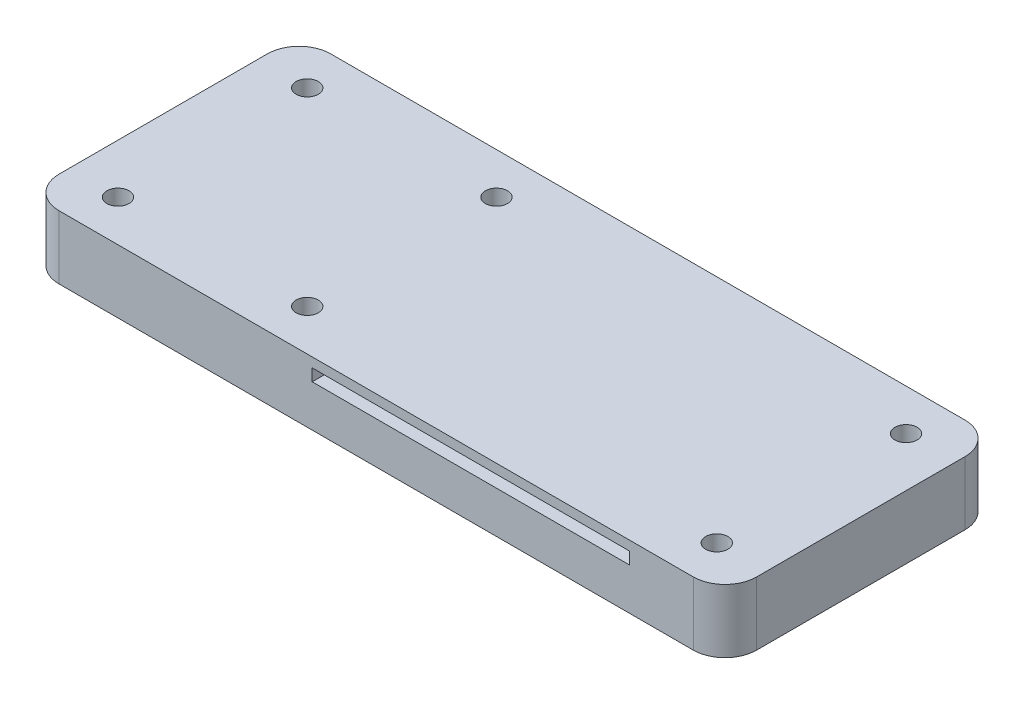
ISO-10303-21;
HEADER;
FILE_DESCRIPTION(('STEP AP214'),'2;1');
FILE_NAME('part.step','',(''),(''),'','','');
FILE_SCHEMA(('AUTOMOTIVE_DESIGN { 1 0 10303 214 1 1 1 1 }'));
ENDSEC;
DATA;
#1=APPLICATION_CONTEXT('core data for automotive mechanical design processes');
#2=APPLICATION_PROTOCOL_DEFINITION('international standard','automotive_design',2000,#1);
#3=PRODUCT_CONTEXT('',#1,'mechanical');
#4=PRODUCT('Part','Part','',(#3));
#5=PRODUCT_RELATED_PRODUCT_CATEGORY('part','',(#4));
#6=PRODUCT_DEFINITION_FORMATION('','',#4);
#7=PRODUCT_DEFINITION_CONTEXT('part definition',#1,'design');
#8=PRODUCT_DEFINITION('design','',#6,#7);
#9=PRODUCT_DEFINITION_SHAPE('','',#8);
#10=(LENGTH_UNIT() NAMED_UNIT(*) SI_UNIT(.MILLI.,.METRE.));
#11=(NAMED_UNIT(*) PLANE_ANGLE_UNIT() SI_UNIT($,.RADIAN.));
#12=(NAMED_UNIT(*) SI_UNIT($,.STERADIAN.) SOLID_ANGLE_UNIT());
#13=UNCERTAINTY_MEASURE_WITH_UNIT(LENGTH_MEASURE(1.E-05),#10,'distance_accuracy_value','');
#14=(GEOMETRIC_REPRESENTATION_CONTEXT(3) GLOBAL_UNCERTAINTY_ASSIGNED_CONTEXT((#13)) GLOBAL_UNIT_ASSIGNED_CONTEXT((#10,
#11,#12)) REPRESENTATION_CONTEXT('',''));
#15=CARTESIAN_POINT('',(0.,0.,0.));
#16=DIRECTION('',(0.,0.,1.));
#17=DIRECTION('',(1.,0.,0.));
#18=AXIS2_PLACEMENT_3D('',#15,#16,#17);
#19=CARTESIAN_POINT('',(-50.,5.,16.42));
#20=DIRECTION('',(0.,1.,0.));
#21=DIRECTION('',(0.,0.,1.));
#22=AXIS2_PLACEMENT_3D('',#19,#20,#21);
#23=PLANE('',#22);
#24=CARTESIAN_POINT('',(47.2099530830362,5.,-14.9199530830362));
#25=DIRECTION('',(0.,1.,0.));
#26=DIRECTION('',(0.,0.,1.));
#27=AXIS2_PLACEMENT_3D('',#24,#25,#26);
#28=CIRCLE('',#27,1.75);
#29=CARTESIAN_POINT('',(47.2099530830362,5.,-13.1699530830361));
#30=VERTEX_POINT('',#29);
#31=EDGE_CURVE('E186',#30,#30,#28,.T.);
#32=ORIENTED_EDGE('',*,*,#31,.F.);
#33=EDGE_LOOP('',(#32));
#34=FACE_BOUND('',#33,.T.);
#35=CARTESIAN_POINT('',(-17.3700469169638,5.,14.9199530830362));
#36=DIRECTION('',(0.,1.,0.));
#37=DIRECTION('',(0.,0.,1.));
#38=AXIS2_PLACEMENT_3D('',#35,#36,#37);
#39=CIRCLE('',#38,1.75);
#40=CARTESIAN_POINT('',(-17.3700469169638,5.,16.6699530830362));
#41=VERTEX_POINT('',#40);
#42=EDGE_CURVE('E202',#41,#41,#39,.T.);
#43=ORIENTED_EDGE('',*,*,#42,.F.);
#44=EDGE_LOOP('',(#43));
#45=FACE_BOUND('',#44,.T.);
#46=CARTESIAN_POINT('',(-47.2099530830362,5.,-14.9199530830362));
#47=DIRECTION('',(0.,1.,0.));
#48=DIRECTION('',(0.,0.,1.));
#49=AXIS2_PLACEMENT_3D('',#46,#47,#48);
#50=CIRCLE('',#49,1.75);
#51=CARTESIAN_POINT('',(-47.2099530830362,5.,-13.1699530830361));
#52=VERTEX_POINT('',#51);
#53=EDGE_CURVE('E218',#52,#52,#50,.T.);
#54=ORIENTED_EDGE('',*,*,#53,.F.);
#55=EDGE_LOOP('',(#54));
#56=FACE_BOUND('',#55,.T.);
#57=CARTESIAN_POINT('',(-50.,5.,16.42));
#58=DIRECTION('',(0.,1.,0.));
#59=DIRECTION('',(0.,0.,1.));
#60=AXIS2_PLACEMENT_3D('',#57,#58,#59);
#61=CIRCLE('',#60,5.);
#62=CARTESIAN_POINT('',(-55.,5.,16.42));
#63=VERTEX_POINT('',#62);
#64=CARTESIAN_POINT('',(-50.,5.,21.42));
#65=VERTEX_POINT('',#64);
#66=EDGE_CURVE('E226',#63,#65,#61,.T.);
#67=ORIENTED_EDGE('',*,*,#66,.T.);
#68=DIRECTION('',(1.,0.,0.));
#69=VECTOR('',#68,1.);
#70=CARTESIAN_POINT('',(-50.,5.,21.42));
#71=LINE('',#70,#69);
#72=CARTESIAN_POINT('',(50.,5.,21.42));
#73=VERTEX_POINT('',#72);
#74=EDGE_CURVE('E230',#65,#73,#71,.T.);
#75=ORIENTED_EDGE('',*,*,#74,.T.);
#76=CARTESIAN_POINT('',(50.,5.,16.42));
#77=DIRECTION('',(0.,1.,0.));
#78=DIRECTION('',(0.,0.,1.));
#79=AXIS2_PLACEMENT_3D('',#76,#77,#78);
#80=CIRCLE('',#79,5.);
#81=CARTESIAN_POINT('',(55.,5.,16.42));
#82=VERTEX_POINT('',#81);
#83=EDGE_CURVE('E234',#73,#82,#80,.T.);
#84=ORIENTED_EDGE('',*,*,#83,.T.);
#85=DIRECTION('',(0.,0.,-1.));
#86=VECTOR('',#85,1.);
#87=CARTESIAN_POINT('',(55.,5.,16.42));
#88=LINE('',#87,#86);
#89=CARTESIAN_POINT('',(55.,5.,-16.42));
#90=VERTEX_POINT('',#89);
#91=EDGE_CURVE('E237',#82,#90,#88,.T.);
#92=ORIENTED_EDGE('',*,*,#91,.T.);
#93=CARTESIAN_POINT('',(50.,5.,-16.42));
#94=DIRECTION('',(0.,1.,0.));
#95=DIRECTION('',(0.,0.,1.));
#96=AXIS2_PLACEMENT_3D('',#93,#94,#95);
#97=CIRCLE('',#96,5.);
#98=CARTESIAN_POINT('',(50.,5.,-21.42));
#99=VERTEX_POINT('',#98);
#100=EDGE_CURVE('E240',#90,#99,#97,.T.);
#101=ORIENTED_EDGE('',*,*,#100,.T.);
#102=DIRECTION('',(-1.,0.,0.));
#103=VECTOR('',#102,1.);
#104=CARTESIAN_POINT('',(-50.,5.,-21.42));
#105=LINE('',#104,#103);
#106=CARTESIAN_POINT('',(-50.,5.,-21.42));
#107=VERTEX_POINT('',#106);
#108=EDGE_CURVE('E243',#99,#107,#105,.T.);
#109=ORIENTED_EDGE('',*,*,#108,.T.);
#110=CARTESIAN_POINT('',(-50.,5.,-16.42));
#111=DIRECTION('',(0.,1.,0.));
#112=DIRECTION('',(0.,0.,1.));
#113=AXIS2_PLACEMENT_3D('',#110,#111,#112);
#114=CIRCLE('',#113,5.);
#115=CARTESIAN_POINT('',(-55.,5.,-16.42));
#116=VERTEX_POINT('',#115);
#117=EDGE_CURVE('E246',#107,#116,#114,.T.);
#118=ORIENTED_EDGE('',*,*,#117,.T.);
#119=DIRECTION('',(0.,0.,1.));
#120=VECTOR('',#119,1.);
#121=CARTESIAN_POINT('',(-55.,5.,16.42));
#122=LINE('',#121,#120);
#123=EDGE_CURVE('E249',#116,#63,#122,.T.);
#124=ORIENTED_EDGE('',*,*,#123,.T.);
#125=EDGE_LOOP('',(#67,#75,#84,#92,#101,#109,#118,#124));
#126=FACE_BOUND('',#125,.T.);
#127=CARTESIAN_POINT('',(-17.3700469169638,5.,-14.9199530830362));
#128=DIRECTION('',(0.,1.,0.));
#129=DIRECTION('',(0.,0.,1.));
#130=AXIS2_PLACEMENT_3D('',#127,#128,#129);
#131=CIRCLE('',#130,1.75);
#132=CARTESIAN_POINT('',(-17.3700469169638,5.,-13.1699530830362));
#133=VERTEX_POINT('',#132);
#134=EDGE_CURVE('E210',#133,#133,#131,.T.);
#135=ORIENTED_EDGE('',*,*,#134,.F.);
#136=EDGE_LOOP('',(#135));
#137=FACE_BOUND('',#136,.T.);
#138=CARTESIAN_POINT('',(-47.2099530830362,5.,14.9199530830362));
#139=DIRECTION('',(0.,1.,0.));
#140=DIRECTION('',(0.,0.,1.));
#141=AXIS2_PLACEMENT_3D('',#138,#139,#140);
#142=CIRCLE('',#141,1.75);
#143=CARTESIAN_POINT('',(-47.2099530830362,5.,16.6699530830362));
#144=VERTEX_POINT('',#143);
#145=EDGE_CURVE('E194',#144,#144,#142,.T.);
#146=ORIENTED_EDGE('',*,*,#145,.F.);
#147=EDGE_LOOP('',(#146));
#148=FACE_BOUND('',#147,.T.);
#149=CARTESIAN_POINT('',(47.2099530830362,5.,14.9199530830362));
#150=DIRECTION('',(0.,1.,0.));
#151=DIRECTION('',(0.,0.,1.));
#152=AXIS2_PLACEMENT_3D('',#149,#150,#151);
#153=CIRCLE('',#152,1.75);
#154=CARTESIAN_POINT('',(47.2099530830362,5.,16.6699530830362));
#155=VERTEX_POINT('',#154);
#156=EDGE_CURVE('E178',#155,#155,#153,.T.);
#157=ORIENTED_EDGE('',*,*,#156,.F.);
#158=EDGE_LOOP('',(#157));
#159=FACE_BOUND('',#158,.T.);
#160=ADVANCED_FACE('F39',(#34,#45,#56,#126,#137,#148,#159),#23,.T.);
#161=CARTESIAN_POINT('',(-50.,-5.,16.42));
#162=DIRECTION('',(0.,1.,0.));
#163=DIRECTION('',(0.,0.,1.));
#164=AXIS2_PLACEMENT_3D('',#161,#162,#163);
#165=PLANE('',#164);
#166=CARTESIAN_POINT('',(-50.,-5.,16.42));
#167=DIRECTION('',(0.,1.,0.));
#168=DIRECTION('',(0.,0.,1.));
#169=AXIS2_PLACEMENT_3D('',#166,#167,#168);
#170=CIRCLE('',#169,5.);
#171=CARTESIAN_POINT('',(-55.,-5.,16.42));
#172=VERTEX_POINT('',#171);
#173=CARTESIAN_POINT('',(-50.,-5.,21.42));
#174=VERTEX_POINT('',#173);
#175=EDGE_CURVE('E222',#172,#174,#170,.T.);
#176=ORIENTED_EDGE('',*,*,#175,.F.);
#177=DIRECTION('',(0.,0.,1.));
#178=VECTOR('',#177,1.);
#179=CARTESIAN_POINT('',(-55.,-5.,16.42));
#180=LINE('',#179,#178);
#181=CARTESIAN_POINT('',(-55.,-5.,-16.42));
#182=VERTEX_POINT('',#181);
#183=EDGE_CURVE('E231',#182,#172,#180,.T.);
#184=ORIENTED_EDGE('',*,*,#183,.F.);
#185=CARTESIAN_POINT('',(-50.,-5.,-16.42));
#186=DIRECTION('',(0.,1.,0.));
#187=DIRECTION('',(0.,0.,1.));
#188=AXIS2_PLACEMENT_3D('',#185,#186,#187);
#189=CIRCLE('',#188,5.);
#190=CARTESIAN_POINT('',(-50.,-5.,-21.42));
#191=VERTEX_POINT('',#190);
#192=EDGE_CURVE('E271',#191,#182,#189,.T.);
#193=ORIENTED_EDGE('',*,*,#192,.F.);
#194=DIRECTION('',(-1.,0.,0.));
#195=VECTOR('',#194,1.);
#196=CARTESIAN_POINT('',(-50.,-5.,-21.42));
#197=LINE('',#196,#195);
#198=CARTESIAN_POINT('',(50.,-5.,-21.42));
#199=VERTEX_POINT('',#198);
#200=EDGE_CURVE('E268',#199,#191,#197,.T.);
#201=ORIENTED_EDGE('',*,*,#200,.F.);
#202=CARTESIAN_POINT('',(50.,-5.,-16.42));
#203=DIRECTION('',(0.,1.,0.));
#204=DIRECTION('',(0.,0.,1.));
#205=AXIS2_PLACEMENT_3D('',#202,#203,#204);
#206=CIRCLE('',#205,5.);
#207=CARTESIAN_POINT('',(55.,-5.,-16.42));
#208=VERTEX_POINT('',#207);
#209=EDGE_CURVE('E265',#208,#199,#206,.T.);
#210=ORIENTED_EDGE('',*,*,#209,.F.);
#211=DIRECTION('',(0.,0.,-1.));
#212=VECTOR('',#211,1.);
#213=CARTESIAN_POINT('',(55.,-5.,16.42));
#214=LINE('',#213,#212);
#215=CARTESIAN_POINT('',(55.,-5.,16.42));
#216=VERTEX_POINT('',#215);
#217=EDGE_CURVE('E262',#216,#208,#214,.T.);
#218=ORIENTED_EDGE('',*,*,#217,.F.);
#219=CARTESIAN_POINT('',(50.,-5.,16.42));
#220=DIRECTION('',(0.,1.,0.));
#221=DIRECTION('',(0.,0.,1.));
#222=AXIS2_PLACEMENT_3D('',#219,#220,#221);
#223=CIRCLE('',#222,5.);
#224=CARTESIAN_POINT('',(50.,-5.,21.42));
#225=VERTEX_POINT('',#224);
#226=EDGE_CURVE('E259',#225,#216,#223,.T.);
#227=ORIENTED_EDGE('',*,*,#226,.F.);
#228=DIRECTION('',(1.,0.,0.));
#229=VECTOR('',#228,1.);
#230=CARTESIAN_POINT('',(-50.,-5.,21.42));
#231=LINE('',#230,#229);
#232=EDGE_CURVE('E256',#174,#225,#231,.T.);
#233=ORIENTED_EDGE('',*,*,#232,.F.);
#234=EDGE_LOOP('',(#176,#184,#193,#201,#210,#218,#227,#233));
#235=FACE_BOUND('',#234,.T.);
#236=CARTESIAN_POINT('',(-47.2099530830362,-5.,-14.9199530830362));
#237=DIRECTION('',(0.,1.,0.));
#238=DIRECTION('',(0.,0.,1.));
#239=AXIS2_PLACEMENT_3D('',#236,#237,#238);
#240=CIRCLE('',#239,1.75);
#241=CARTESIAN_POINT('',(-47.2099530830362,-5.,-13.1699530830361));
#242=VERTEX_POINT('',#241);
#243=EDGE_CURVE('E214',#242,#242,#240,.T.);
#244=ORIENTED_EDGE('',*,*,#243,.T.);
#245=EDGE_LOOP('',(#244));
#246=FACE_BOUND('',#245,.T.);
#247=CARTESIAN_POINT('',(-17.3700469169638,-5.,-14.9199530830362));
#248=DIRECTION('',(0.,1.,0.));
#249=DIRECTION('',(0.,0.,1.));
#250=AXIS2_PLACEMENT_3D('',#247,#248,#249);
#251=CIRCLE('',#250,1.75);
#252=CARTESIAN_POINT('',(-17.3700469169638,-5.,-13.1699530830362));
#253=VERTEX_POINT('',#252);
#254=EDGE_CURVE('E206',#253,#253,#251,.T.);
#255=ORIENTED_EDGE('',*,*,#254,.T.);
#256=EDGE_LOOP('',(#255));
#257=FACE_BOUND('',#256,.T.);
#258=CARTESIAN_POINT('',(-17.3700469169638,-5.,14.9199530830362));
#259=DIRECTION('',(0.,1.,0.));
#260=DIRECTION('',(0.,0.,1.));
#261=AXIS2_PLACEMENT_3D('',#258,#259,#260);
#262=CIRCLE('',#261,1.75);
#263=CARTESIAN_POINT('',(-17.3700469169638,-5.,16.6699530830362));
#264=VERTEX_POINT('',#263);
#265=EDGE_CURVE('E198',#264,#264,#262,.T.);
#266=ORIENTED_EDGE('',*,*,#265,.T.);
#267=EDGE_LOOP('',(#266));
#268=FACE_BOUND('',#267,.T.);
#269=CARTESIAN_POINT('',(-47.2099530830362,-5.,14.9199530830362));
#270=DIRECTION('',(0.,1.,0.));
#271=DIRECTION('',(0.,0.,1.));
#272=AXIS2_PLACEMENT_3D('',#269,#270,#271);
#273=CIRCLE('',#272,1.75);
#274=CARTESIAN_POINT('',(-47.2099530830362,-5.,16.6699530830362));
#275=VERTEX_POINT('',#274);
#276=EDGE_CURVE('E190',#275,#275,#273,.T.);
#277=ORIENTED_EDGE('',*,*,#276,.T.);
#278=EDGE_LOOP('',(#277));
#279=FACE_BOUND('',#278,.T.);
#280=CARTESIAN_POINT('',(47.2099530830362,-5.,-14.9199530830362));
#281=DIRECTION('',(0.,1.,0.));
#282=DIRECTION('',(0.,0.,1.));
#283=AXIS2_PLACEMENT_3D('',#280,#281,#282);
#284=CIRCLE('',#283,1.75);
#285=CARTESIAN_POINT('',(47.2099530830362,-5.,-13.1699530830361));
#286=VERTEX_POINT('',#285);
#287=EDGE_CURVE('E182',#286,#286,#284,.T.);
#288=ORIENTED_EDGE('',*,*,#287,.T.);
#289=EDGE_LOOP('',(#288));
#290=FACE_BOUND('',#289,.T.);
#291=CARTESIAN_POINT('',(47.2099530830362,-5.,14.9199530830362));
#292=DIRECTION('',(0.,1.,0.));
#293=DIRECTION('',(0.,0.,1.));
#294=AXIS2_PLACEMENT_3D('',#291,#292,#293);
#295=CIRCLE('',#294,1.75);
#296=CARTESIAN_POINT('',(47.2099530830362,-5.,16.6699530830362));
#297=VERTEX_POINT('',#296);
#298=EDGE_CURVE('E172',#297,#297,#295,.T.);
#299=ORIENTED_EDGE('',*,*,#298,.T.);
#300=EDGE_LOOP('',(#299));
#301=FACE_BOUND('',#300,.T.);
#302=ADVANCED_FACE('F310',(#235,#246,#257,#268,#279,#290,#301),#165,.F.);
#303=CARTESIAN_POINT('',(-50.,5.,16.42));
#304=DIRECTION('',(0.,-1.,0.));
#305=DIRECTION('',(0.,0.,-1.));
#306=AXIS2_PLACEMENT_3D('',#303,#304,#305);
#307=CYLINDRICAL_SURFACE('',#306,5.);
#308=ORIENTED_EDGE('',*,*,#175,.T.);
#309=DIRECTION('',(0.,-1.,0.));
#310=VECTOR('',#309,1.);
#311=CARTESIAN_POINT('',(-50.,5.,21.42));
#312=LINE('',#311,#310);
#313=EDGE_CURVE('E11',#65,#174,#312,.T.);
#314=ORIENTED_EDGE('',*,*,#313,.F.);
#315=ORIENTED_EDGE('',*,*,#66,.F.);
#316=DIRECTION('',(0.,-1.,0.));
#317=VECTOR('',#316,1.);
#318=CARTESIAN_POINT('',(-55.,5.,16.42));
#319=LINE('',#318,#317);
#320=EDGE_CURVE('E252',#63,#172,#319,.T.);
#321=ORIENTED_EDGE('',*,*,#320,.T.);
#322=EDGE_LOOP('',(#308,#314,#315,#321));
#323=FACE_BOUND('',#322,.T.);
#324=ADVANCED_FACE('F41',(#323),#307,.T.);
#325=CARTESIAN_POINT('',(-50.,5.,21.42));
#326=DIRECTION('',(0.,0.,-1.));
#327=DIRECTION('',(-1.,0.,0.));
#328=AXIS2_PLACEMENT_3D('',#325,#326,#327);
#329=PLANE('',#328);
#330=DIRECTION('',(1.,0.,0.));
#331=VECTOR('',#330,1.);
#332=CARTESIAN_POINT('',(-10.0800469169639,1.6,21.42));
#333=LINE('',#332,#331);
#334=CARTESIAN_POINT('',(-10.0800469169638,1.6,21.42));
#335=VERTEX_POINT('',#334);
#336=CARTESIAN_POINT('',(39.9199530830362,1.6,21.42));
#337=VERTEX_POINT('',#336);
#338=EDGE_CURVE('E163',#335,#337,#333,.T.);
#339=ORIENTED_EDGE('',*,*,#338,.F.);
#340=DIRECTION('',(0.,-1.,0.));
#341=VECTOR('',#340,1.);
#342=CARTESIAN_POINT('',(-10.0800469169639,3.5,21.42));
#343=LINE('',#342,#341);
#344=CARTESIAN_POINT('',(-10.0800469169639,3.5,21.42));
#345=VERTEX_POINT('',#344);
#346=EDGE_CURVE('E55',#345,#335,#343,.T.);
#347=ORIENTED_EDGE('',*,*,#346,.F.);
#348=DIRECTION('',(-1.,0.,0.));
#349=VECTOR('',#348,1.);
#350=CARTESIAN_POINT('',(-10.0800469169639,3.5,21.42));
#351=LINE('',#350,#349);
#352=CARTESIAN_POINT('',(39.9199530830362,3.5,21.42));
#353=VERTEX_POINT('',#352);
#354=EDGE_CURVE('E150',#353,#345,#351,.T.);
#355=ORIENTED_EDGE('',*,*,#354,.F.);
#356=DIRECTION('',(0.,1.,0.));
#357=VECTOR('',#356,1.);
#358=CARTESIAN_POINT('',(39.9199530830362,3.5,21.42));
#359=LINE('',#358,#357);
#360=EDGE_CURVE('E154',#337,#353,#359,.T.);
#361=ORIENTED_EDGE('',*,*,#360,.F.);
#362=EDGE_LOOP('',(#339,#347,#355,#361));
#363=FACE_BOUND('',#362,.T.);
#364=ORIENTED_EDGE('',*,*,#232,.T.);
#365=DIRECTION('',(0.,-1.,0.));
#366=VECTOR('',#365,1.);
#367=CARTESIAN_POINT('',(50.,5.,21.42));
#368=LINE('',#367,#366);
#369=EDGE_CURVE('E48',#73,#225,#368,.T.);
#370=ORIENTED_EDGE('',*,*,#369,.F.);
#371=ORIENTED_EDGE('',*,*,#74,.F.);
#372=ORIENTED_EDGE('',*,*,#313,.T.);
#373=EDGE_LOOP('',(#364,#370,#371,#372));
#374=FACE_BOUND('',#373,.T.);
#375=ADVANCED_FACE('F328',(#363,#374),#329,.F.);
#376=CARTESIAN_POINT('',(50.,5.,16.42));
#377=DIRECTION('',(0.,-1.,0.));
#378=DIRECTION('',(0.,0.,-1.));
#379=AXIS2_PLACEMENT_3D('',#376,#377,#378);
#380=CYLINDRICAL_SURFACE('',#379,5.);
#381=ORIENTED_EDGE('',*,*,#226,.T.);
#382=DIRECTION('',(0.,-1.,0.));
#383=VECTOR('',#382,1.);
#384=CARTESIAN_POINT('',(55.,5.,16.42));
#385=LINE('',#384,#383);
#386=EDGE_CURVE('E295',#82,#216,#385,.T.);
#387=ORIENTED_EDGE('',*,*,#386,.F.);
#388=ORIENTED_EDGE('',*,*,#83,.F.);
#389=ORIENTED_EDGE('',*,*,#369,.T.);
#390=EDGE_LOOP('',(#381,#387,#388,#389));
#391=FACE_BOUND('',#390,.T.);
#392=ADVANCED_FACE('F304',(#391),#380,.T.);
#393=CARTESIAN_POINT('',(55.,5.,16.42));
#394=DIRECTION('',(-1.,0.,0.));
#395=DIRECTION('',(0.,0.,1.));
#396=AXIS2_PLACEMENT_3D('',#393,#394,#395);
#397=PLANE('',#396);
#398=ORIENTED_EDGE('',*,*,#217,.T.);
#399=DIRECTION('',(0.,-1.,0.));
#400=VECTOR('',#399,1.);
#401=CARTESIAN_POINT('',(55.,5.,-16.42));
#402=LINE('',#401,#400);
#403=EDGE_CURVE('E291',#90,#208,#402,.T.);
#404=ORIENTED_EDGE('',*,*,#403,.F.);
#405=ORIENTED_EDGE('',*,*,#91,.F.);
#406=ORIENTED_EDGE('',*,*,#386,.T.);
#407=EDGE_LOOP('',(#398,#404,#405,#406));
#408=FACE_BOUND('',#407,.T.);
#409=ADVANCED_FACE('F316',(#408),#397,.F.);
#410=CARTESIAN_POINT('',(50.,5.,-16.42));
#411=DIRECTION('',(0.,-1.,0.));
#412=DIRECTION('',(0.,0.,-1.));
#413=AXIS2_PLACEMENT_3D('',#410,#411,#412);
#414=CYLINDRICAL_SURFACE('',#413,5.);
#415=ORIENTED_EDGE('',*,*,#209,.T.);
#416=DIRECTION('',(0.,-1.,0.));
#417=VECTOR('',#416,1.);
#418=CARTESIAN_POINT('',(50.,5.,-21.42));
#419=LINE('',#418,#417);
#420=EDGE_CURVE('E287',#99,#199,#419,.T.);
#421=ORIENTED_EDGE('',*,*,#420,.F.);
#422=ORIENTED_EDGE('',*,*,#100,.F.);
#423=ORIENTED_EDGE('',*,*,#403,.T.);
#424=EDGE_LOOP('',(#415,#421,#422,#423));
#425=FACE_BOUND('',#424,.T.);
#426=ADVANCED_FACE('F320',(#425),#414,.T.);
#427=CARTESIAN_POINT('',(-50.,5.,-21.42));
#428=DIRECTION('',(0.,0.,1.));
#429=DIRECTION('',(1.,0.,0.));
#430=AXIS2_PLACEMENT_3D('',#427,#428,#429);
#431=PLANE('',#430);
#432=DIRECTION('',(-1.,0.,0.));
#433=VECTOR('',#432,1.);
#434=CARTESIAN_POINT('',(-10.0800469169639,3.5,-21.42));
#435=LINE('',#434,#433);
#436=CARTESIAN_POINT('',(39.9199530830362,3.5,-21.42));
#437=VERTEX_POINT('',#436);
#438=CARTESIAN_POINT('',(-10.0800469169639,3.5,-21.42));
#439=VERTEX_POINT('',#438);
#440=EDGE_CURVE('E138',#437,#439,#435,.T.);
#441=ORIENTED_EDGE('',*,*,#440,.T.);
#442=DIRECTION('',(0.,-1.,0.));
#443=VECTOR('',#442,1.);
#444=CARTESIAN_POINT('',(-10.0800469169639,3.5,-21.42));
#445=LINE('',#444,#443);
#446=CARTESIAN_POINT('',(-10.0800469169639,1.6,-21.42));
#447=VERTEX_POINT('',#446);
#448=EDGE_CURVE('E131',#439,#447,#445,.T.);
#449=ORIENTED_EDGE('',*,*,#448,.T.);
#450=DIRECTION('',(1.,0.,0.));
#451=VECTOR('',#450,1.);
#452=CARTESIAN_POINT('',(-10.0800469169639,1.6,-21.42));
#453=LINE('',#452,#451);
#454=CARTESIAN_POINT('',(39.9199530830362,1.6,-21.42));
#455=VERTEX_POINT('',#454);
#456=EDGE_CURVE('E141',#447,#455,#453,.T.);
#457=ORIENTED_EDGE('',*,*,#456,.T.);
#458=DIRECTION('',(0.,1.,0.));
#459=VECTOR('',#458,1.);
#460=CARTESIAN_POINT('',(39.9199530830362,3.5,-21.42));
#461=LINE('',#460,#459);
#462=EDGE_CURVE('E63',#455,#437,#461,.T.);
#463=ORIENTED_EDGE('',*,*,#462,.T.);
#464=EDGE_LOOP('',(#441,#449,#457,#463));
#465=FACE_BOUND('',#464,.T.);
#466=ORIENTED_EDGE('',*,*,#200,.T.);
#467=DIRECTION('',(0.,-1.,0.));
#468=VECTOR('',#467,1.);
#469=CARTESIAN_POINT('',(-50.,5.,-21.42));
#470=LINE('',#469,#468);
#471=EDGE_CURVE('E283',#107,#191,#470,.T.);
#472=ORIENTED_EDGE('',*,*,#471,.F.);
#473=ORIENTED_EDGE('',*,*,#108,.F.);
#474=ORIENTED_EDGE('',*,*,#420,.T.);
#475=EDGE_LOOP('',(#466,#472,#473,#474));
#476=FACE_BOUND('',#475,.T.);
#477=ADVANCED_FACE('F146',(#465,#476),#431,.F.);
#478=CARTESIAN_POINT('',(-50.,5.,-16.42));
#479=DIRECTION('',(0.,-1.,0.));
#480=DIRECTION('',(0.,0.,-1.));
#481=AXIS2_PLACEMENT_3D('',#478,#479,#480);
#482=CYLINDRICAL_SURFACE('',#481,5.);
#483=ORIENTED_EDGE('',*,*,#192,.T.);
#484=DIRECTION('',(0.,-1.,0.));
#485=VECTOR('',#484,1.);
#486=CARTESIAN_POINT('',(-55.,5.,-16.42));
#487=LINE('',#486,#485);
#488=EDGE_CURVE('E279',#116,#182,#487,.T.);
#489=ORIENTED_EDGE('',*,*,#488,.F.);
#490=ORIENTED_EDGE('',*,*,#117,.F.);
#491=ORIENTED_EDGE('',*,*,#471,.T.);
#492=EDGE_LOOP('',(#483,#489,#490,#491));
#493=FACE_BOUND('',#492,.T.);
#494=ADVANCED_FACE('F339',(#493),#482,.T.);
#495=CARTESIAN_POINT('',(-55.,5.,16.42));
#496=DIRECTION('',(1.,0.,0.));
#497=DIRECTION('',(0.,0.,-1.));
#498=AXIS2_PLACEMENT_3D('',#495,#496,#497);
#499=PLANE('',#498);
#500=ORIENTED_EDGE('',*,*,#183,.T.);
#501=ORIENTED_EDGE('',*,*,#320,.F.);
#502=ORIENTED_EDGE('',*,*,#123,.F.);
#503=ORIENTED_EDGE('',*,*,#488,.T.);
#504=EDGE_LOOP('',(#500,#501,#502,#503));
#505=FACE_BOUND('',#504,.T.);
#506=ADVANCED_FACE('F334',(#505),#499,.F.);
#507=CARTESIAN_POINT('',(-47.2099530830362,5.,-14.9199530830362));
#508=DIRECTION('',(0.,-1.,0.));
#509=DIRECTION('',(0.,0.,-1.));
#510=AXIS2_PLACEMENT_3D('',#507,#508,#509);
#511=CYLINDRICAL_SURFACE('',#510,1.75);
#512=ORIENTED_EDGE('',*,*,#53,.T.);
#513=EDGE_LOOP('',(#512));
#514=FACE_BOUND('',#513,.T.);
#515=ORIENTED_EDGE('',*,*,#243,.F.);
#516=EDGE_LOOP('',(#515));
#517=FACE_BOUND('',#516,.T.);
#518=ADVANCED_FACE('F358',(#514,#517),#511,.F.);
#519=CARTESIAN_POINT('',(-17.3700469169638,5.,-14.9199530830362));
#520=DIRECTION('',(0.,-1.,0.));
#521=DIRECTION('',(0.,0.,-1.));
#522=AXIS2_PLACEMENT_3D('',#519,#520,#521);
#523=CYLINDRICAL_SURFACE('',#522,1.75);
#524=ORIENTED_EDGE('',*,*,#134,.T.);
#525=EDGE_LOOP('',(#524));
#526=FACE_BOUND('',#525,.T.);
#527=ORIENTED_EDGE('',*,*,#254,.F.);
#528=EDGE_LOOP('',(#527));
#529=FACE_BOUND('',#528,.T.);
#530=ADVANCED_FACE('F365',(#526,#529),#523,.F.);
#531=CARTESIAN_POINT('',(-17.3700469169638,5.,14.9199530830362));
#532=DIRECTION('',(0.,-1.,0.));
#533=DIRECTION('',(0.,0.,-1.));
#534=AXIS2_PLACEMENT_3D('',#531,#532,#533);
#535=CYLINDRICAL_SURFACE('',#534,1.75);
#536=ORIENTED_EDGE('',*,*,#42,.T.);
#537=EDGE_LOOP('',(#536));
#538=FACE_BOUND('',#537,.T.);
#539=ORIENTED_EDGE('',*,*,#265,.F.);
#540=EDGE_LOOP('',(#539));
#541=FACE_BOUND('',#540,.T.);
#542=ADVANCED_FACE('F370',(#538,#541),#535,.F.);
#543=CARTESIAN_POINT('',(-47.2099530830362,5.,14.9199530830362));
#544=DIRECTION('',(0.,-1.,0.));
#545=DIRECTION('',(0.,0.,-1.));
#546=AXIS2_PLACEMENT_3D('',#543,#544,#545);
#547=CYLINDRICAL_SURFACE('',#546,1.75);
#548=ORIENTED_EDGE('',*,*,#145,.T.);
#549=EDGE_LOOP('',(#548));
#550=FACE_BOUND('',#549,.T.);
#551=ORIENTED_EDGE('',*,*,#276,.F.);
#552=EDGE_LOOP('',(#551));
#553=FACE_BOUND('',#552,.T.);
#554=ADVANCED_FACE('F397',(#550,#553),#547,.F.);
#555=CARTESIAN_POINT('',(47.2099530830362,5.,-14.9199530830362));
#556=DIRECTION('',(0.,-1.,0.));
#557=DIRECTION('',(0.,0.,-1.));
#558=AXIS2_PLACEMENT_3D('',#555,#556,#557);
#559=CYLINDRICAL_SURFACE('',#558,1.75);
#560=ORIENTED_EDGE('',*,*,#31,.T.);
#561=EDGE_LOOP('',(#560));
#562=FACE_BOUND('',#561,.T.);
#563=ORIENTED_EDGE('',*,*,#287,.F.);
#564=EDGE_LOOP('',(#563));
#565=FACE_BOUND('',#564,.T.);
#566=ADVANCED_FACE('F388',(#562,#565),#559,.F.);
#567=CARTESIAN_POINT('',(47.2099530830362,5.,14.9199530830362));
#568=DIRECTION('',(0.,-1.,0.));
#569=DIRECTION('',(0.,0.,-1.));
#570=AXIS2_PLACEMENT_3D('',#567,#568,#569);
#571=CYLINDRICAL_SURFACE('',#570,1.75);
#572=ORIENTED_EDGE('',*,*,#156,.T.);
#573=EDGE_LOOP('',(#572));
#574=FACE_BOUND('',#573,.T.);
#575=ORIENTED_EDGE('',*,*,#298,.F.);
#576=EDGE_LOOP('',(#575));
#577=FACE_BOUND('',#576,.T.);
#578=ADVANCED_FACE('F386',(#574,#577),#571,.F.);
#579=CARTESIAN_POINT('',(-10.0800469169639,3.5,-21.42));
#580=DIRECTION('',(-1.,0.,0.));
#581=DIRECTION('',(0.,0.,1.));
#582=AXIS2_PLACEMENT_3D('',#579,#580,#581);
#583=PLANE('',#582);
#584=ORIENTED_EDGE('',*,*,#346,.T.);
#585=DIRECTION('',(0.,0.,1.));
#586=VECTOR('',#585,1.);
#587=CARTESIAN_POINT('',(-10.0800469169639,1.6,-21.42));
#588=LINE('',#587,#586);
#589=EDGE_CURVE('E127',#447,#335,#588,.T.);
#590=ORIENTED_EDGE('',*,*,#589,.F.);
#591=ORIENTED_EDGE('',*,*,#448,.F.);
#592=DIRECTION('',(0.,0.,1.));
#593=VECTOR('',#592,1.);
#594=CARTESIAN_POINT('',(-10.0800469169639,3.5,-21.42));
#595=LINE('',#594,#593);
#596=EDGE_CURVE('E169',#439,#345,#595,.T.);
#597=ORIENTED_EDGE('',*,*,#596,.T.);
#598=EDGE_LOOP('',(#584,#590,#591,#597));
#599=FACE_BOUND('',#598,.T.);
#600=ADVANCED_FACE('F129',(#599),#583,.F.);
#601=CARTESIAN_POINT('',(-10.0800469169639,3.5,-21.42));
#602=DIRECTION('',(0.,1.,0.));
#603=DIRECTION('',(-1.,0.,0.));
#604=AXIS2_PLACEMENT_3D('',#601,#602,#603);
#605=PLANE('',#604);
#606=ORIENTED_EDGE('',*,*,#354,.T.);
#607=ORIENTED_EDGE('',*,*,#596,.F.);
#608=ORIENTED_EDGE('',*,*,#440,.F.);
#609=DIRECTION('',(0.,0.,1.));
#610=VECTOR('',#609,1.);
#611=CARTESIAN_POINT('',(39.9199530830362,3.5,-21.42));
#612=LINE('',#611,#610);
#613=EDGE_CURVE('E173',#437,#353,#612,.T.);
#614=ORIENTED_EDGE('',*,*,#613,.T.);
#615=EDGE_LOOP('',(#606,#607,#608,#614));
#616=FACE_BOUND('',#615,.T.);
#617=ADVANCED_FACE('F395',(#616),#605,.F.);
#618=CARTESIAN_POINT('',(39.9199530830362,3.5,-21.42));
#619=DIRECTION('',(1.,0.,0.));
#620=DIRECTION('',(0.,0.,-1.));
#621=AXIS2_PLACEMENT_3D('',#618,#619,#620);
#622=PLANE('',#621);
#623=ORIENTED_EDGE('',*,*,#360,.T.);
#624=ORIENTED_EDGE('',*,*,#613,.F.);
#625=ORIENTED_EDGE('',*,*,#462,.F.);
#626=DIRECTION('',(0.,0.,1.));
#627=VECTOR('',#626,1.);
#628=CARTESIAN_POINT('',(39.9199530830362,1.6,-21.42));
#629=LINE('',#628,#627);
#630=EDGE_CURVE('E137',#455,#337,#629,.T.);
#631=ORIENTED_EDGE('',*,*,#630,.T.);
#632=EDGE_LOOP('',(#623,#624,#625,#631));
#633=FACE_BOUND('',#632,.T.);
#634=ADVANCED_FACE('F459',(#633),#622,.F.);
#635=CARTESIAN_POINT('',(-10.0800469169639,1.6,-21.42));
#636=DIRECTION('',(0.,-1.,0.));
#637=DIRECTION('',(0.,0.,-1.));
#638=AXIS2_PLACEMENT_3D('',#635,#636,#637);
#639=PLANE('',#638);
#640=ORIENTED_EDGE('',*,*,#338,.T.);
#641=ORIENTED_EDGE('',*,*,#630,.F.);
#642=ORIENTED_EDGE('',*,*,#456,.F.);
#643=ORIENTED_EDGE('',*,*,#589,.T.);
#644=EDGE_LOOP('',(#640,#641,#642,#643));
#645=FACE_BOUND('',#644,.T.);
#646=ADVANCED_FACE('F142',(#645),#639,.F.);
#647=CLOSED_SHELL('',(#160,#302,#324,#375,#392,#409,#426,#477,#494,#506,#518,#530,#542,#554,
#566,#578,#600,#617,#634,#646));
#648=MANIFOLD_SOLID_BREP('B2',#647);
#649=ADVANCED_BREP_SHAPE_REPRESENTATION('',(#18,#648),#14);
#650=SHAPE_DEFINITION_REPRESENTATION(#9,#649);
ENDSEC;
END-ISO-10303-21;
